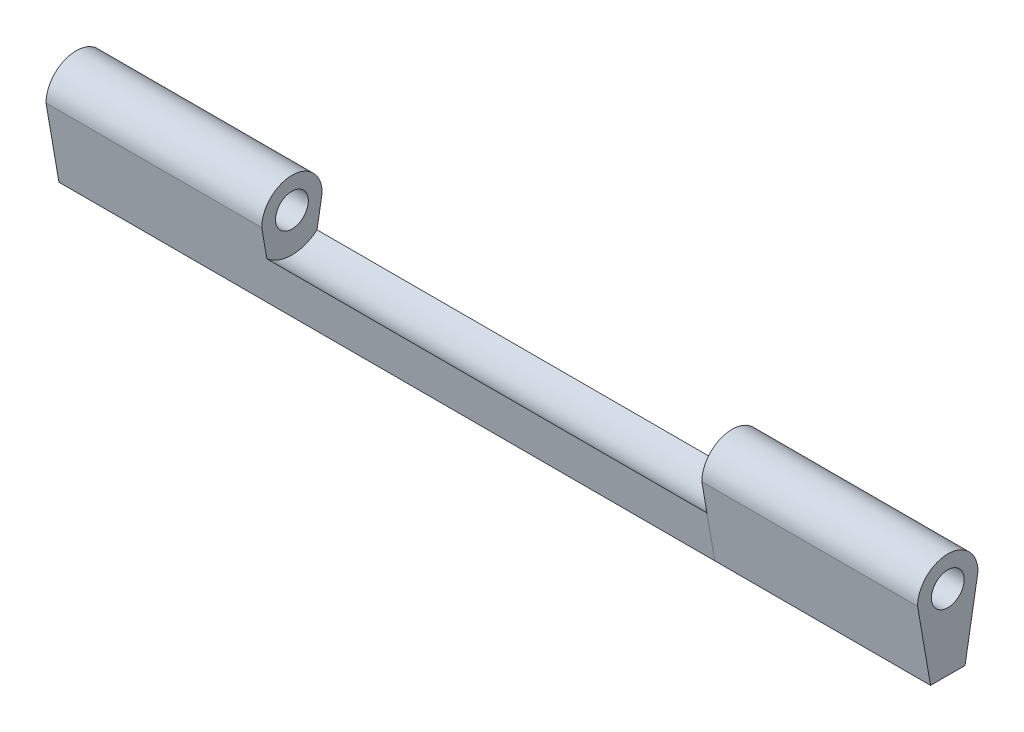
ISO-10303-21;
HEADER;
FILE_DESCRIPTION(('STEP AP214'),'2;1');
FILE_NAME('part.step','',(''),(''),'','','');
FILE_SCHEMA(('AUTOMOTIVE_DESIGN { 1 0 10303 214 1 1 1 1 }'));
ENDSEC;
DATA;
#1=APPLICATION_CONTEXT('core data for automotive mechanical design processes');
#2=APPLICATION_PROTOCOL_DEFINITION('international standard','automotive_design',2000,#1);
#3=PRODUCT_CONTEXT('',#1,'mechanical');
#4=PRODUCT('Part','Part','',(#3));
#5=PRODUCT_RELATED_PRODUCT_CATEGORY('part','',(#4));
#6=PRODUCT_DEFINITION_FORMATION('','',#4);
#7=PRODUCT_DEFINITION_CONTEXT('part definition',#1,'design');
#8=PRODUCT_DEFINITION('design','',#6,#7);
#9=PRODUCT_DEFINITION_SHAPE('','',#8);
#10=(LENGTH_UNIT() NAMED_UNIT(*) SI_UNIT(.MILLI.,.METRE.));
#11=(NAMED_UNIT(*) PLANE_ANGLE_UNIT() SI_UNIT($,.RADIAN.));
#12=(NAMED_UNIT(*) SI_UNIT($,.STERADIAN.) SOLID_ANGLE_UNIT());
#13=UNCERTAINTY_MEASURE_WITH_UNIT(LENGTH_MEASURE(1.E-05),#10,'distance_accuracy_value','');
#14=(GEOMETRIC_REPRESENTATION_CONTEXT(3) GLOBAL_UNCERTAINTY_ASSIGNED_CONTEXT((#13)) GLOBAL_UNIT_ASSIGNED_CONTEXT((#10,
#11,#12)) REPRESENTATION_CONTEXT('',''));
#15=CARTESIAN_POINT('',(0.,0.,0.));
#16=DIRECTION('',(0.,0.,1.));
#17=DIRECTION('',(1.,0.,0.));
#18=AXIS2_PLACEMENT_3D('',#15,#16,#17);
#19=CARTESIAN_POINT('',(101.,0.,0.));
#20=DIRECTION('',(-1.,0.,0.));
#21=DIRECTION('',(0.,0.,1.));
#22=AXIS2_PLACEMENT_3D('',#19,#20,#21);
#23=PLANE('',#22);
#24=CARTESIAN_POINT('',(101.,0.,0.));
#25=DIRECTION('',(1.,0.,0.));
#26=DIRECTION('',(0.,0.,-1.));
#27=AXIS2_PLACEMENT_3D('',#24,#25,#26);
#28=CIRCLE('',#27,1.9);
#29=CARTESIAN_POINT('',(101.,0.,-1.9));
#30=VERTEX_POINT('',#29);
#31=EDGE_CURVE('E127',#30,#30,#28,.T.);
#32=ORIENTED_EDGE('',*,*,#31,.F.);
#33=EDGE_LOOP('',(#32));
#34=FACE_BOUND('',#33,.T.);
#35=CARTESIAN_POINT('',(101.,0.,0.));
#36=DIRECTION('',(1.,0.,0.));
#37=DIRECTION('',(0.,0.,1.));
#38=AXIS2_PLACEMENT_3D('',#35,#36,#37);
#39=CIRCLE('',#38,3.5);
#40=CARTESIAN_POINT('',(101.,0.,-3.5));
#41=VERTEX_POINT('',#40);
#42=CARTESIAN_POINT('',(101.,0.,3.5));
#43=VERTEX_POINT('',#42);
#44=EDGE_CURVE('E101',#41,#43,#39,.T.);
#45=ORIENTED_EDGE('',*,*,#44,.T.);
#46=DIRECTION('',(0.,-0.985460115744348,-0.169906916507647));
#47=VECTOR('',#46,1.);
#48=CARTESIAN_POINT('',(101.,0.,3.5));
#49=LINE('',#48,#47);
#50=CARTESIAN_POINT('',(101.,-8.69999999999998,2.));
#51=VERTEX_POINT('',#50);
#52=EDGE_CURVE('E97',#43,#51,#49,.T.);
#53=ORIENTED_EDGE('',*,*,#52,.T.);
#54=DIRECTION('',(0.,0.,-1.));
#55=VECTOR('',#54,1.);
#56=CARTESIAN_POINT('',(101.,-8.69999999999998,2.));
#57=LINE('',#56,#55);
#58=CARTESIAN_POINT('',(101.,-8.69999999999998,-2.));
#59=VERTEX_POINT('',#58);
#60=EDGE_CURVE('E99',#51,#59,#57,.T.);
#61=ORIENTED_EDGE('',*,*,#60,.T.);
#62=DIRECTION('',(0.,0.985460115744348,-0.169906916507647));
#63=VECTOR('',#62,1.);
#64=CARTESIAN_POINT('',(101.,-8.69999999999998,-2.));
#65=LINE('',#64,#63);
#66=EDGE_CURVE('E67',#59,#41,#65,.T.);
#67=ORIENTED_EDGE('',*,*,#66,.T.);
#68=EDGE_LOOP('',(#45,#53,#61,#67));
#69=FACE_BOUND('',#68,.T.);
#70=ADVANCED_FACE('F49',(#34,#69),#23,.F.);
#71=CARTESIAN_POINT('',(76.,0.,0.));
#72=DIRECTION('',(-1.,0.,0.));
#73=DIRECTION('',(0.,0.,1.));
#74=AXIS2_PLACEMENT_3D('',#71,#72,#73);
#75=PLANE('',#74);
#76=CARTESIAN_POINT('',(76.,0.,0.));
#77=DIRECTION('',(-1.,0.,0.));
#78=DIRECTION('',(0.,0.,1.));
#79=AXIS2_PLACEMENT_3D('',#76,#77,#78);
#80=CIRCLE('',#79,1.9);
#81=CARTESIAN_POINT('',(76.,0.,1.9));
#82=VERTEX_POINT('',#81);
#83=EDGE_CURVE('E53',#82,#82,#80,.T.);
#84=ORIENTED_EDGE('',*,*,#83,.F.);
#85=EDGE_LOOP('',(#84));
#86=FACE_BOUND('',#85,.T.);
#87=CARTESIAN_POINT('',(76.,0.,0.));
#88=DIRECTION('',(1.,0.,0.));
#89=DIRECTION('',(0.,0.,1.));
#90=AXIS2_PLACEMENT_3D('',#87,#88,#89);
#91=CIRCLE('',#90,3.5);
#92=CARTESIAN_POINT('',(76.,0.,-3.5));
#93=VERTEX_POINT('',#92);
#94=CARTESIAN_POINT('',(76.,0.,3.5));
#95=VERTEX_POINT('',#94);
#96=EDGE_CURVE('E114',#93,#95,#91,.T.);
#97=ORIENTED_EDGE('',*,*,#96,.F.);
#98=DIRECTION('',(0.,0.985460115744348,-0.169906916507647));
#99=VECTOR('',#98,1.);
#100=CARTESIAN_POINT('',(76.,-8.69999999999998,-2.));
#101=LINE('',#100,#99);
#102=CARTESIAN_POINT('',(76.,-8.69999999999998,-2.));
#103=VERTEX_POINT('',#102);
#104=EDGE_CURVE('E90',#103,#93,#101,.T.);
#105=ORIENTED_EDGE('',*,*,#104,.F.);
#106=DIRECTION('',(0.,0.,-1.));
#107=VECTOR('',#106,1.);
#108=CARTESIAN_POINT('',(76.,-8.69999999999998,2.));
#109=LINE('',#108,#107);
#110=CARTESIAN_POINT('',(76.,-8.69999999999998,2.));
#111=VERTEX_POINT('',#110);
#112=EDGE_CURVE('E84',#111,#103,#109,.T.);
#113=ORIENTED_EDGE('',*,*,#112,.F.);
#114=DIRECTION('',(0.,-0.985460115744348,-0.169906916507647));
#115=VECTOR('',#114,1.);
#116=CARTESIAN_POINT('',(76.,0.,3.5));
#117=LINE('',#116,#115);
#118=EDGE_CURVE('E105',#95,#111,#117,.T.);
#119=ORIENTED_EDGE('',*,*,#118,.F.);
#120=EDGE_LOOP('',(#97,#105,#113,#119));
#121=FACE_BOUND('',#120,.T.);
#122=ADVANCED_FACE('F124',(#86,#121),#75,.T.);
#123=CARTESIAN_POINT('',(101.,0.,0.));
#124=DIRECTION('',(-1.,0.,0.));
#125=DIRECTION('',(0.,0.,1.));
#126=AXIS2_PLACEMENT_3D('',#123,#124,#125);
#127=CYLINDRICAL_SURFACE('',#126,3.5);
#128=ORIENTED_EDGE('',*,*,#96,.T.);
#129=DIRECTION('',(-1.,0.,0.));
#130=VECTOR('',#129,1.);
#131=CARTESIAN_POINT('',(101.,0.,3.5));
#132=LINE('',#131,#130);
#133=EDGE_CURVE('E12',#43,#95,#132,.T.);
#134=ORIENTED_EDGE('',*,*,#133,.F.);
#135=ORIENTED_EDGE('',*,*,#44,.F.);
#136=DIRECTION('',(-1.,0.,0.));
#137=VECTOR('',#136,1.);
#138=CARTESIAN_POINT('',(101.,0.,-3.5));
#139=LINE('',#138,#137);
#140=EDGE_CURVE('E110',#41,#93,#139,.T.);
#141=ORIENTED_EDGE('',*,*,#140,.T.);
#142=EDGE_LOOP('',(#128,#134,#135,#141));
#143=FACE_BOUND('',#142,.T.);
#144=ADVANCED_FACE('F51',(#143),#127,.T.);
#145=CARTESIAN_POINT('',(101.,0.,3.5));
#146=DIRECTION('',(0.,0.169906916507647,-0.985460115744348));
#147=DIRECTION('',(0.,0.985460115744348,0.169906916507647));
#148=AXIS2_PLACEMENT_3D('',#145,#146,#147);
#149=PLANE('',#148);
#150=ORIENTED_EDGE('',*,*,#118,.T.);
#151=DIRECTION('',(-1.,0.,0.));
#152=VECTOR('',#151,1.);
#153=CARTESIAN_POINT('',(101.,-8.69999999999998,2.));
#154=LINE('',#153,#152);
#155=EDGE_CURVE('E59',#51,#111,#154,.T.);
#156=ORIENTED_EDGE('',*,*,#155,.F.);
#157=ORIENTED_EDGE('',*,*,#52,.F.);
#158=ORIENTED_EDGE('',*,*,#133,.T.);
#159=EDGE_LOOP('',(#150,#156,#157,#158));
#160=FACE_BOUND('',#159,.T.);
#161=ADVANCED_FACE('F104',(#160),#149,.F.);
#162=CARTESIAN_POINT('',(101.,-8.69999999999998,2.));
#163=DIRECTION('',(0.,1.,0.));
#164=DIRECTION('',(0.,0.,1.));
#165=AXIS2_PLACEMENT_3D('',#162,#163,#164);
#166=PLANE('',#165);
#167=ORIENTED_EDGE('',*,*,#112,.T.);
#168=DIRECTION('',(-1.,0.,0.));
#169=VECTOR('',#168,1.);
#170=CARTESIAN_POINT('',(101.,-8.69999999999998,-2.));
#171=LINE('',#170,#169);
#172=EDGE_CURVE('E106',#59,#103,#171,.T.);
#173=ORIENTED_EDGE('',*,*,#172,.F.);
#174=ORIENTED_EDGE('',*,*,#60,.F.);
#175=ORIENTED_EDGE('',*,*,#155,.T.);
#176=EDGE_LOOP('',(#167,#173,#174,#175));
#177=FACE_BOUND('',#176,.T.);
#178=ADVANCED_FACE('F108',(#177),#166,.F.);
#179=CARTESIAN_POINT('',(101.,-8.69999999999998,-2.));
#180=DIRECTION('',(0.,0.169906916507647,0.985460115744348));
#181=DIRECTION('',(0.,-0.985460115744348,0.169906916507647));
#182=AXIS2_PLACEMENT_3D('',#179,#180,#181);
#183=PLANE('',#182);
#184=ORIENTED_EDGE('',*,*,#104,.T.);
#185=ORIENTED_EDGE('',*,*,#140,.F.);
#186=ORIENTED_EDGE('',*,*,#66,.F.);
#187=ORIENTED_EDGE('',*,*,#172,.T.);
#188=EDGE_LOOP('',(#184,#185,#186,#187));
#189=FACE_BOUND('',#188,.T.);
#190=ADVANCED_FACE('F121',(#189),#183,.F.);
#191=CARTESIAN_POINT('',(0.,0.,0.));
#192=DIRECTION('',(1.,0.,0.));
#193=DIRECTION('',(0.,0.,-1.));
#194=AXIS2_PLACEMENT_3D('',#191,#192,#193);
#195=CYLINDRICAL_SURFACE('',#194,1.9);
#196=ORIENTED_EDGE('',*,*,#83,.T.);
#197=EDGE_LOOP('',(#196));
#198=FACE_BOUND('',#197,.T.);
#199=ORIENTED_EDGE('',*,*,#31,.T.);
#200=EDGE_LOOP('',(#199));
#201=FACE_BOUND('',#200,.T.);
#202=ADVANCED_FACE('F134',(#198,#201),#195,.F.);
#203=CLOSED_SHELL('',(#70,#122,#144,#161,#178,#190,#202));
#204=MANIFOLD_SOLID_BREP('B2',#203);
#205=CARTESIAN_POINT('',(25.,0.,0.));
#206=DIRECTION('',(1.,0.,0.));
#207=DIRECTION('',(0.,0.,-1.));
#208=AXIS2_PLACEMENT_3D('',#205,#206,#207);
#209=PLANE('',#208);
#210=CARTESIAN_POINT('',(25.,0.,0.));
#211=DIRECTION('',(1.,0.,0.));
#212=DIRECTION('',(0.,0.,-1.));
#213=AXIS2_PLACEMENT_3D('',#210,#211,#212);
#214=CIRCLE('',#213,1.9);
#215=CARTESIAN_POINT('',(25.,0.,-1.9));
#216=VERTEX_POINT('',#215);
#217=EDGE_CURVE('E276',#216,#216,#214,.T.);
#218=ORIENTED_EDGE('',*,*,#217,.F.);
#219=EDGE_LOOP('',(#218));
#220=FACE_BOUND('',#219,.T.);
#221=CARTESIAN_POINT('',(25.,0.,0.));
#222=DIRECTION('',(-1.,0.,0.));
#223=DIRECTION('',(0.,0.,-1.));
#224=AXIS2_PLACEMENT_3D('',#221,#222,#223);
#225=CIRCLE('',#224,4.5);
#226=CARTESIAN_POINT('',(25.,-3.43426955710062,-2.90788455912058));
#227=VERTEX_POINT('',#226);
#228=CARTESIAN_POINT('',(25.,-3.43426955710062,2.90788455912058));
#229=VERTEX_POINT('',#228);
#230=EDGE_CURVE('E223',#227,#229,#225,.T.);
#231=ORIENTED_EDGE('',*,*,#230,.F.);
#232=DIRECTION('',(0.,0.985460115744348,-0.169906916507647));
#233=VECTOR('',#232,1.);
#234=CARTESIAN_POINT('',(25.,-8.69999999999998,-2.));
#235=LINE('',#234,#233);
#236=CARTESIAN_POINT('',(25.,0.,-3.5));
#237=VERTEX_POINT('',#236);
#238=EDGE_CURVE('E261',#227,#237,#235,.T.);
#239=ORIENTED_EDGE('',*,*,#238,.T.);
#240=CARTESIAN_POINT('',(25.,0.,0.));
#241=DIRECTION('',(1.,0.,0.));
#242=DIRECTION('',(0.,0.,-1.));
#243=AXIS2_PLACEMENT_3D('',#240,#241,#242);
#244=CIRCLE('',#243,3.5);
#245=CARTESIAN_POINT('',(25.,0.,3.5));
#246=VERTEX_POINT('',#245);
#247=EDGE_CURVE('E229',#237,#246,#244,.T.);
#248=ORIENTED_EDGE('',*,*,#247,.T.);
#249=DIRECTION('',(0.,-0.985460115744348,-0.169906916507647));
#250=VECTOR('',#249,1.);
#251=CARTESIAN_POINT('',(25.,0.,3.5));
#252=LINE('',#251,#250);
#253=EDGE_CURVE('E271',#246,#229,#252,.T.);
#254=ORIENTED_EDGE('',*,*,#253,.T.);
#255=EDGE_LOOP('',(#231,#239,#248,#254));
#256=FACE_BOUND('',#255,.T.);
#257=ADVANCED_FACE('F208',(#220,#256),#209,.T.);
#258=CARTESIAN_POINT('',(0.,0.,0.));
#259=DIRECTION('',(1.,0.,0.));
#260=DIRECTION('',(0.,0.,-1.));
#261=AXIS2_PLACEMENT_3D('',#258,#259,#260);
#262=PLANE('',#261);
#263=DIRECTION('',(0.,0.,-1.));
#264=VECTOR('',#263,1.);
#265=CARTESIAN_POINT('',(0.,-8.69999999999998,2.));
#266=LINE('',#265,#264);
#267=CARTESIAN_POINT('',(0.,-8.69999999999998,2.));
#268=VERTEX_POINT('',#267);
#269=CARTESIAN_POINT('',(0.,-8.69999999999998,-2.));
#270=VERTEX_POINT('',#269);
#271=EDGE_CURVE('E267',#268,#270,#266,.T.);
#272=ORIENTED_EDGE('',*,*,#271,.F.);
#273=DIRECTION('',(0.,-0.985460115744348,-0.169906916507647));
#274=VECTOR('',#273,1.);
#275=CARTESIAN_POINT('',(0.,0.,3.5));
#276=LINE('',#275,#274);
#277=CARTESIAN_POINT('',(0.,0.,3.5));
#278=VERTEX_POINT('',#277);
#279=EDGE_CURVE('E249',#278,#268,#276,.T.);
#280=ORIENTED_EDGE('',*,*,#279,.F.);
#281=CARTESIAN_POINT('',(0.,0.,0.));
#282=DIRECTION('',(1.,0.,0.));
#283=DIRECTION('',(0.,0.,-1.));
#284=AXIS2_PLACEMENT_3D('',#281,#282,#283);
#285=CIRCLE('',#284,3.5);
#286=CARTESIAN_POINT('',(0.,0.,-3.5));
#287=VERTEX_POINT('',#286);
#288=EDGE_CURVE('E262',#287,#278,#285,.T.);
#289=ORIENTED_EDGE('',*,*,#288,.F.);
#290=DIRECTION('',(0.,0.985460115744348,-0.169906916507647));
#291=VECTOR('',#290,1.);
#292=CARTESIAN_POINT('',(0.,-8.69999999999998,-2.));
#293=LINE('',#292,#291);
#294=EDGE_CURVE('E275',#270,#287,#293,.T.);
#295=ORIENTED_EDGE('',*,*,#294,.F.);
#296=EDGE_LOOP('',(#272,#280,#289,#295));
#297=FACE_BOUND('',#296,.T.);
#298=CARTESIAN_POINT('',(0.,0.,0.));
#299=DIRECTION('',(1.,0.,0.));
#300=DIRECTION('',(0.,0.,-1.));
#301=AXIS2_PLACEMENT_3D('',#298,#299,#300);
#302=CIRCLE('',#301,1.9);
#303=CARTESIAN_POINT('',(0.,0.,-1.9));
#304=VERTEX_POINT('',#303);
#305=EDGE_CURVE('E280',#304,#304,#302,.T.);
#306=ORIENTED_EDGE('',*,*,#305,.T.);
#307=EDGE_LOOP('',(#306));
#308=FACE_BOUND('',#307,.T.);
#309=ADVANCED_FACE('F273',(#297,#308),#262,.F.);
#310=CARTESIAN_POINT('',(25.,-8.69999999999998,2.));
#311=DIRECTION('',(0.,1.,0.));
#312=DIRECTION('',(0.,0.,1.));
#313=AXIS2_PLACEMENT_3D('',#310,#311,#312);
#314=PLANE('',#313);
#315=ORIENTED_EDGE('',*,*,#271,.T.);
#316=DIRECTION('',(-1.,0.,0.));
#317=VECTOR('',#316,1.);
#318=CARTESIAN_POINT('',(25.,-8.69999999999998,-2.));
#319=LINE('',#318,#317);
#320=CARTESIAN_POINT('',(76.,-8.69999999999998,-2.));
#321=VERTEX_POINT('',#320);
#322=EDGE_CURVE('E47',#321,#270,#319,.T.);
#323=ORIENTED_EDGE('',*,*,#322,.F.);
#324=DIRECTION('',(0.,0.,-1.));
#325=VECTOR('',#324,1.);
#326=CARTESIAN_POINT('',(76.,-8.69999999999998,2.));
#327=LINE('',#326,#325);
#328=CARTESIAN_POINT('',(76.,-8.69999999999998,2.));
#329=VERTEX_POINT('',#328);
#330=EDGE_CURVE('E269',#329,#321,#327,.T.);
#331=ORIENTED_EDGE('',*,*,#330,.F.);
#332=DIRECTION('',(-1.,0.,0.));
#333=VECTOR('',#332,1.);
#334=CARTESIAN_POINT('',(25.,-8.69999999999998,2.));
#335=LINE('',#334,#333);
#336=EDGE_CURVE('E254',#329,#268,#335,.T.);
#337=ORIENTED_EDGE('',*,*,#336,.T.);
#338=EDGE_LOOP('',(#315,#323,#331,#337));
#339=FACE_BOUND('',#338,.T.);
#340=ADVANCED_FACE('F210',(#339),#314,.F.);
#341=CARTESIAN_POINT('',(25.,-8.69999999999998,-2.));
#342=DIRECTION('',(0.,0.169906916507647,0.985460115744348));
#343=DIRECTION('',(0.,-0.985460115744348,0.169906916507647));
#344=AXIS2_PLACEMENT_3D('',#341,#342,#343);
#345=PLANE('',#344);
#346=ORIENTED_EDGE('',*,*,#294,.T.);
#347=DIRECTION('',(-1.,0.,0.));
#348=VECTOR('',#347,1.);
#349=CARTESIAN_POINT('',(25.,0.,-3.5));
#350=LINE('',#349,#348);
#351=EDGE_CURVE('E216',#237,#287,#350,.T.);
#352=ORIENTED_EDGE('',*,*,#351,.F.);
#353=ORIENTED_EDGE('',*,*,#238,.F.);
#354=DIRECTION('',(-1.,0.,0.));
#355=VECTOR('',#354,1.);
#356=CARTESIAN_POINT('',(76.,-3.43426955710062,-2.90788455912058));
#357=LINE('',#356,#355);
#358=CARTESIAN_POINT('',(76.,-3.43426955710062,-2.90788455912058));
#359=VERTEX_POINT('',#358);
#360=EDGE_CURVE('E314',#359,#227,#357,.T.);
#361=ORIENTED_EDGE('',*,*,#360,.F.);
#362=DIRECTION('',(0.,0.985460115744348,-0.169906916507647));
#363=VECTOR('',#362,1.);
#364=CARTESIAN_POINT('',(76.,-8.69999999999998,-2.));
#365=LINE('',#364,#363);
#366=EDGE_CURVE('E297',#321,#359,#365,.T.);
#367=ORIENTED_EDGE('',*,*,#366,.F.);
#368=ORIENTED_EDGE('',*,*,#322,.T.);
#369=EDGE_LOOP('',(#346,#352,#353,#361,#367,#368));
#370=FACE_BOUND('',#369,.T.);
#371=ADVANCED_FACE('F291',(#370),#345,.F.);
#372=CARTESIAN_POINT('',(25.,0.,0.));
#373=DIRECTION('',(-1.,0.,0.));
#374=DIRECTION('',(0.,0.,1.));
#375=AXIS2_PLACEMENT_3D('',#372,#373,#374);
#376=CYLINDRICAL_SURFACE('',#375,3.5);
#377=ORIENTED_EDGE('',*,*,#288,.T.);
#378=DIRECTION('',(-1.,0.,0.));
#379=VECTOR('',#378,1.);
#380=CARTESIAN_POINT('',(25.,0.,3.5));
#381=LINE('',#380,#379);
#382=EDGE_CURVE('E257',#246,#278,#381,.T.);
#383=ORIENTED_EDGE('',*,*,#382,.F.);
#384=ORIENTED_EDGE('',*,*,#247,.F.);
#385=ORIENTED_EDGE('',*,*,#351,.T.);
#386=EDGE_LOOP('',(#377,#383,#384,#385));
#387=FACE_BOUND('',#386,.T.);
#388=ADVANCED_FACE('F289',(#387),#376,.T.);
#389=CARTESIAN_POINT('',(25.,0.,3.5));
#390=DIRECTION('',(0.,0.169906916507647,-0.985460115744348));
#391=DIRECTION('',(0.,0.985460115744348,0.169906916507647));
#392=AXIS2_PLACEMENT_3D('',#389,#390,#391);
#393=PLANE('',#392);
#394=ORIENTED_EDGE('',*,*,#279,.T.);
#395=ORIENTED_EDGE('',*,*,#336,.F.);
#396=DIRECTION('',(0.,-0.985460115744348,-0.169906916507647));
#397=VECTOR('',#396,1.);
#398=CARTESIAN_POINT('',(76.,-3.43426955710062,2.90788455912058));
#399=LINE('',#398,#397);
#400=CARTESIAN_POINT('',(76.,-3.43426955710062,2.90788455912058));
#401=VERTEX_POINT('',#400);
#402=EDGE_CURVE('E303',#401,#329,#399,.T.);
#403=ORIENTED_EDGE('',*,*,#402,.F.);
#404=DIRECTION('',(-1.,0.,0.));
#405=VECTOR('',#404,1.);
#406=CARTESIAN_POINT('',(76.,-3.43426955710062,2.90788455912058));
#407=LINE('',#406,#405);
#408=EDGE_CURVE('E310',#401,#229,#407,.T.);
#409=ORIENTED_EDGE('',*,*,#408,.T.);
#410=ORIENTED_EDGE('',*,*,#253,.F.);
#411=ORIENTED_EDGE('',*,*,#382,.T.);
#412=EDGE_LOOP('',(#394,#395,#403,#409,#410,#411));
#413=FACE_BOUND('',#412,.T.);
#414=ADVANCED_FACE('F251',(#413),#393,.F.);
#415=CARTESIAN_POINT('',(25.,0.,0.));
#416=DIRECTION('',(-1.,0.,0.));
#417=DIRECTION('',(0.,0.,1.));
#418=AXIS2_PLACEMENT_3D('',#415,#416,#417);
#419=CYLINDRICAL_SURFACE('',#418,1.9);
#420=ORIENTED_EDGE('',*,*,#217,.T.);
#421=EDGE_LOOP('',(#420));
#422=FACE_BOUND('',#421,.T.);
#423=ORIENTED_EDGE('',*,*,#305,.F.);
#424=EDGE_LOOP('',(#423));
#425=FACE_BOUND('',#424,.T.);
#426=ADVANCED_FACE('F327',(#422,#425),#419,.F.);
#427=CARTESIAN_POINT('',(76.,0.,0.));
#428=DIRECTION('',(-1.,0.,0.));
#429=DIRECTION('',(0.,0.,1.));
#430=AXIS2_PLACEMENT_3D('',#427,#428,#429);
#431=CYLINDRICAL_SURFACE('',#430,4.5);
#432=ORIENTED_EDGE('',*,*,#230,.T.);
#433=ORIENTED_EDGE('',*,*,#408,.F.);
#434=CARTESIAN_POINT('',(76.,0.,0.));
#435=DIRECTION('',(-1.,0.,0.));
#436=DIRECTION('',(0.,0.,-1.));
#437=AXIS2_PLACEMENT_3D('',#434,#435,#436);
#438=CIRCLE('',#437,4.5);
#439=EDGE_CURVE('E305',#359,#401,#438,.T.);
#440=ORIENTED_EDGE('',*,*,#439,.F.);
#441=ORIENTED_EDGE('',*,*,#360,.T.);
#442=EDGE_LOOP('',(#432,#433,#440,#441));
#443=FACE_BOUND('',#442,.T.);
#444=ADVANCED_FACE('F321',(#443),#431,.F.);
#445=CARTESIAN_POINT('',(76.,0.,0.));
#446=DIRECTION('',(1.,0.,0.));
#447=DIRECTION('',(0.,0.,-1.));
#448=AXIS2_PLACEMENT_3D('',#445,#446,#447);
#449=PLANE('',#448);
#450=ORIENTED_EDGE('',*,*,#402,.T.);
#451=ORIENTED_EDGE('',*,*,#330,.T.);
#452=ORIENTED_EDGE('',*,*,#366,.T.);
#453=ORIENTED_EDGE('',*,*,#439,.T.);
#454=EDGE_LOOP('',(#450,#451,#452,#453));
#455=FACE_BOUND('',#454,.T.);
#456=ADVANCED_FACE('F301',(#455),#449,.T.);
#457=CLOSED_SHELL('',(#257,#309,#340,#371,#388,#414,#426,#444,#456));
#458=MANIFOLD_SOLID_BREP('B6',#457);
#459=ADVANCED_BREP_SHAPE_REPRESENTATION('',(#18,#204,#458),#14);
#460=SHAPE_DEFINITION_REPRESENTATION(#9,#459);
ENDSEC;
END-ISO-10303-21;
